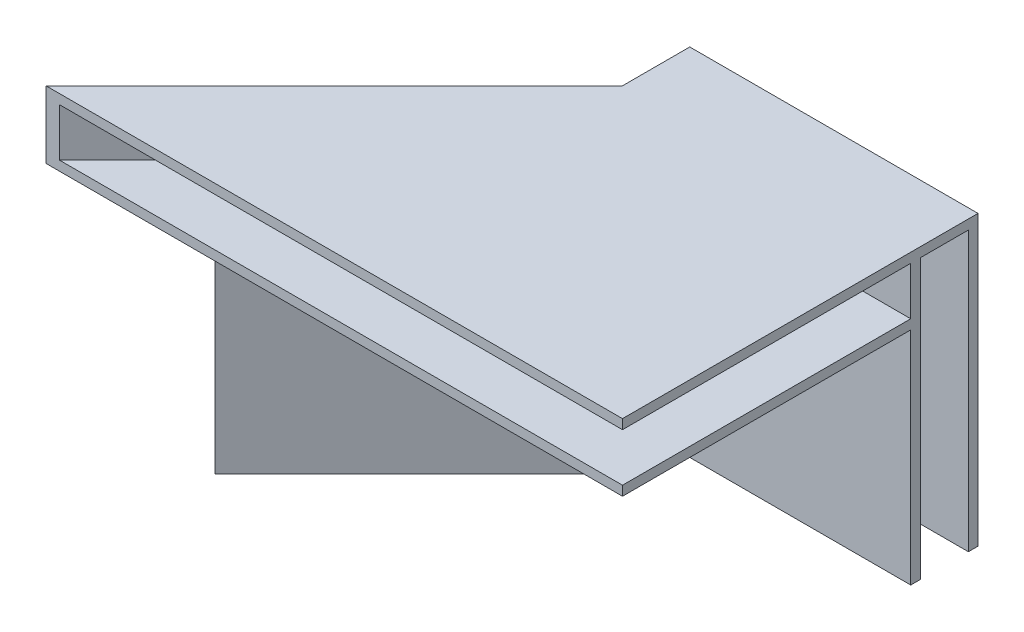
ISO-10303-21;
HEADER;
FILE_DESCRIPTION(('STEP AP214'),'2;1');
FILE_NAME('part.step','',(''),(''),'','','');
FILE_SCHEMA(('AUTOMOTIVE_DESIGN { 1 0 10303 214 1 1 1 1 }'));
ENDSEC;
DATA;
#1=APPLICATION_CONTEXT('core data for automotive mechanical design processes');
#2=APPLICATION_PROTOCOL_DEFINITION('international standard','automotive_design',2000,#1);
#3=PRODUCT_CONTEXT('',#1,'mechanical');
#4=PRODUCT('Part','Part','',(#3));
#5=PRODUCT_RELATED_PRODUCT_CATEGORY('part','',(#4));
#6=PRODUCT_DEFINITION_FORMATION('','',#4);
#7=PRODUCT_DEFINITION_CONTEXT('part definition',#1,'design');
#8=PRODUCT_DEFINITION('design','',#6,#7);
#9=PRODUCT_DEFINITION_SHAPE('','',#8);
#10=(LENGTH_UNIT() NAMED_UNIT(*) SI_UNIT(.MILLI.,.METRE.));
#11=(NAMED_UNIT(*) PLANE_ANGLE_UNIT() SI_UNIT($,.RADIAN.));
#12=(NAMED_UNIT(*) SI_UNIT($,.STERADIAN.) SOLID_ANGLE_UNIT());
#13=UNCERTAINTY_MEASURE_WITH_UNIT(LENGTH_MEASURE(1.E-05),#10,'distance_accuracy_value','');
#14=(GEOMETRIC_REPRESENTATION_CONTEXT(3) GLOBAL_UNCERTAINTY_ASSIGNED_CONTEXT((#13)) GLOBAL_UNIT_ASSIGNED_CONTEXT((#10,
#11,#12)) REPRESENTATION_CONTEXT('',''));
#15=CARTESIAN_POINT('',(0.,0.,0.));
#16=DIRECTION('',(0.,0.,1.));
#17=DIRECTION('',(1.,0.,0.));
#18=AXIS2_PLACEMENT_3D('',#15,#16,#17);
#19=CARTESIAN_POINT('',(0.,0.,7.));
#20=DIRECTION('',(0.,0.,-1.));
#21=DIRECTION('',(-1.,0.,0.));
#22=AXIS2_PLACEMENT_3D('',#19,#20,#21);
#23=PLANE('',#22);
#24=DIRECTION('',(0.,-1.,0.));
#25=VECTOR('',#24,1.);
#26=CARTESIAN_POINT('',(1.,0.,7.));
#27=LINE('',#26,#25);
#28=CARTESIAN_POINT('',(1.,29.,7.));
#29=VERTEX_POINT('',#28);
#30=CARTESIAN_POINT('',(1.,24.,7.));
#31=VERTEX_POINT('',#30);
#32=EDGE_CURVE('E197',#29,#31,#27,.T.);
#33=ORIENTED_EDGE('',*,*,#32,.T.);
#34=DIRECTION('',(1.,0.,0.));
#35=VECTOR('',#34,1.);
#36=CARTESIAN_POINT('',(0.,24.,7.));
#37=LINE('',#36,#35);
#38=CARTESIAN_POINT('',(30.,24.,7.));
#39=VERTEX_POINT('',#38);
#40=EDGE_CURVE('E191',#31,#39,#37,.T.);
#41=ORIENTED_EDGE('',*,*,#40,.T.);
#42=DIRECTION('',(0.,1.,0.));
#43=VECTOR('',#42,1.);
#44=CARTESIAN_POINT('',(30.,24.,7.));
#45=LINE('',#44,#43);
#46=CARTESIAN_POINT('',(30.,29.,7.));
#47=VERTEX_POINT('',#46);
#48=EDGE_CURVE('E194',#39,#47,#45,.T.);
#49=ORIENTED_EDGE('',*,*,#48,.T.);
#50=DIRECTION('',(1.,0.,0.));
#51=VECTOR('',#50,1.);
#52=CARTESIAN_POINT('',(0.,29.,7.));
#53=LINE('',#52,#51);
#54=EDGE_CURVE('E201',#29,#47,#53,.T.);
#55=ORIENTED_EDGE('',*,*,#54,.F.);
#56=EDGE_LOOP('',(#33,#41,#49,#55));
#57=FACE_BOUND('',#56,.T.);
#58=ADVANCED_FACE('F35',(#57),#23,.F.);
#59=CARTESIAN_POINT('',(0.,23.,37.));
#60=DIRECTION('',(0.,1.,0.));
#61=DIRECTION('',(0.,0.,1.));
#62=AXIS2_PLACEMENT_3D('',#59,#60,#61);
#63=PLANE('',#62);
#64=DIRECTION('',(1.,0.,0.));
#65=VECTOR('',#64,1.);
#66=CARTESIAN_POINT('',(0.,23.,37.));
#67=LINE('',#66,#65);
#68=CARTESIAN_POINT('',(-30.,23.,37.));
#69=VERTEX_POINT('',#68);
#70=CARTESIAN_POINT('',(30.,23.,37.));
#71=VERTEX_POINT('',#70);
#72=EDGE_CURVE('E304',#69,#71,#67,.T.);
#73=ORIENTED_EDGE('',*,*,#72,.F.);
#74=DIRECTION('',(-0.707106781186547,0.,0.707106781186547));
#75=VECTOR('',#74,1.);
#76=CARTESIAN_POINT('',(-30.,23.,37.));
#77=LINE('',#76,#75);
#78=CARTESIAN_POINT('',(-21.2132034355964,23.,28.2132034355964));
#79=VERTEX_POINT('',#78);
#80=EDGE_CURVE('E240',#79,#69,#77,.T.);
#81=ORIENTED_EDGE('',*,*,#80,.F.);
#82=DIRECTION('',(-0.707106781186547,0.,-0.707106781186548));
#83=VECTOR('',#82,1.);
#84=CARTESIAN_POINT('',(-16.2132034355964,23.,33.2132034355964));
#85=LINE('',#84,#83);
#86=CARTESIAN_POINT('',(-16.2132034355964,23.,33.2132034355964));
#87=VERTEX_POINT('',#86);
#88=EDGE_CURVE('E58',#87,#79,#85,.T.);
#89=ORIENTED_EDGE('',*,*,#88,.F.);
#90=DIRECTION('',(0.707106781186548,0.,-0.707106781186547));
#91=VECTOR('',#90,1.);
#92=CARTESIAN_POINT('',(-16.2132034355964,23.,33.2132034355964));
#93=LINE('',#92,#91);
#94=CARTESIAN_POINT('',(5.,23.,12.));
#95=VERTEX_POINT('',#94);
#96=EDGE_CURVE('E280',#87,#95,#93,.T.);
#97=ORIENTED_EDGE('',*,*,#96,.T.);
#98=DIRECTION('',(0.,0.,-1.));
#99=VECTOR('',#98,1.);
#100=CARTESIAN_POINT('',(5.,23.,12.));
#101=LINE('',#100,#99);
#102=CARTESIAN_POINT('',(5.,23.,7.));
#103=VERTEX_POINT('',#102);
#104=EDGE_CURVE('E292',#95,#103,#101,.T.);
#105=ORIENTED_EDGE('',*,*,#104,.T.);
#106=DIRECTION('',(1.,0.,0.));
#107=VECTOR('',#106,1.);
#108=CARTESIAN_POINT('',(0.,23.,7.));
#109=LINE('',#108,#107);
#110=CARTESIAN_POINT('',(30.,23.,7.));
#111=VERTEX_POINT('',#110);
#112=EDGE_CURVE('E302',#103,#111,#109,.T.);
#113=ORIENTED_EDGE('',*,*,#112,.T.);
#114=DIRECTION('',(0.,0.,-1.));
#115=VECTOR('',#114,1.);
#116=CARTESIAN_POINT('',(30.,23.,37.));
#117=LINE('',#116,#115);
#118=EDGE_CURVE('E312',#71,#111,#117,.T.);
#119=ORIENTED_EDGE('',*,*,#118,.F.);
#120=EDGE_LOOP('',(#73,#81,#89,#97,#105,#113,#119));
#121=FACE_BOUND('',#120,.T.);
#122=ADVANCED_FACE('F400',(#121),#63,.F.);
#123=CARTESIAN_POINT('',(0.,0.,7.));
#124=DIRECTION('',(0.,0.,-1.));
#125=DIRECTION('',(-1.,0.,0.));
#126=AXIS2_PLACEMENT_3D('',#123,#124,#125);
#127=PLANE('',#126);
#128=DIRECTION('',(0.,1.,0.));
#129=VECTOR('',#128,1.);
#130=CARTESIAN_POINT('',(5.,0.,7.));
#131=LINE('',#130,#129);
#132=CARTESIAN_POINT('',(5.,0.,7.));
#133=VERTEX_POINT('',#132);
#134=EDGE_CURVE('E288',#133,#103,#131,.T.);
#135=ORIENTED_EDGE('',*,*,#134,.F.);
#136=DIRECTION('',(1.,0.,0.));
#137=VECTOR('',#136,1.);
#138=CARTESIAN_POINT('',(0.,0.,7.));
#139=LINE('',#138,#137);
#140=CARTESIAN_POINT('',(30.,0.,7.));
#141=VERTEX_POINT('',#140);
#142=EDGE_CURVE('E345',#133,#141,#139,.T.);
#143=ORIENTED_EDGE('',*,*,#142,.T.);
#144=DIRECTION('',(0.,1.,0.));
#145=VECTOR('',#144,1.);
#146=CARTESIAN_POINT('',(30.,0.,7.));
#147=LINE('',#146,#145);
#148=EDGE_CURVE('E347',#141,#111,#147,.T.);
#149=ORIENTED_EDGE('',*,*,#148,.T.);
#150=ORIENTED_EDGE('',*,*,#112,.F.);
#151=EDGE_LOOP('',(#135,#143,#149,#150));
#152=FACE_BOUND('',#151,.T.);
#153=ADVANCED_FACE('F403',(#152),#127,.F.);
#154=CARTESIAN_POINT('',(0.,0.,7.));
#155=DIRECTION('',(1.,0.,0.));
#156=DIRECTION('',(0.,0.,-1.));
#157=AXIS2_PLACEMENT_3D('',#154,#155,#156);
#158=PLANE('',#157);
#159=DIRECTION('',(0.,0.,-1.));
#160=VECTOR('',#159,1.);
#161=CARTESIAN_POINT('',(0.,0.,7.));
#162=LINE('',#161,#160);
#163=CARTESIAN_POINT('',(0.,0.,7.));
#164=VERTEX_POINT('',#163);
#165=CARTESIAN_POINT('',(0.,0.,0.));
#166=VERTEX_POINT('',#165);
#167=EDGE_CURVE('E11',#164,#166,#162,.T.);
#168=ORIENTED_EDGE('',*,*,#167,.F.);
#169=DIRECTION('',(0.,-1.,0.));
#170=VECTOR('',#169,1.);
#171=CARTESIAN_POINT('',(0.,23.,7.));
#172=LINE('',#171,#170);
#173=CARTESIAN_POINT('',(0.,30.,7.));
#174=VERTEX_POINT('',#173);
#175=EDGE_CURVE('E299',#174,#164,#172,.T.);
#176=ORIENTED_EDGE('',*,*,#175,.F.);
#177=DIRECTION('',(0.,0.,-1.));
#178=VECTOR('',#177,1.);
#179=CARTESIAN_POINT('',(0.,30.,7.));
#180=LINE('',#179,#178);
#181=CARTESIAN_POINT('',(0.,30.,0.));
#182=VERTEX_POINT('',#181);
#183=EDGE_CURVE('E351',#174,#182,#180,.T.);
#184=ORIENTED_EDGE('',*,*,#183,.T.);
#185=DIRECTION('',(0.,-1.,0.));
#186=VECTOR('',#185,1.);
#187=CARTESIAN_POINT('',(0.,0.,0.));
#188=LINE('',#187,#186);
#189=EDGE_CURVE('E336',#182,#166,#188,.T.);
#190=ORIENTED_EDGE('',*,*,#189,.T.);
#191=EDGE_LOOP('',(#168,#176,#184,#190));
#192=FACE_BOUND('',#191,.T.);
#193=ADVANCED_FACE('F37',(#192),#158,.F.);
#194=CARTESIAN_POINT('',(0.,0.,7.));
#195=DIRECTION('',(0.,1.,0.));
#196=DIRECTION('',(0.,0.,1.));
#197=AXIS2_PLACEMENT_3D('',#194,#195,#196);
#198=PLANE('',#197);
#199=DIRECTION('',(0.707106781186547,0.,0.707106781186548));
#200=VECTOR('',#199,1.);
#201=CARTESIAN_POINT('',(-21.2132034355964,0.,28.2132034355964));
#202=LINE('',#201,#200);
#203=CARTESIAN_POINT('',(-16.920310216783,0.,32.5060966544099));
#204=VERTEX_POINT('',#203);
#205=CARTESIAN_POINT('',(-16.2132034355964,0.,33.2132034355964));
#206=VERTEX_POINT('',#205);
#207=EDGE_CURVE('E273',#204,#206,#202,.T.);
#208=ORIENTED_EDGE('',*,*,#207,.F.);
#209=DIRECTION('',(-0.707106781186546,0.,0.707106781186549));
#210=VECTOR('',#209,1.);
#211=CARTESIAN_POINT('',(-16.2132034355964,0.,31.7989898732233));
#212=LINE('',#211,#210);
#213=CARTESIAN_POINT('',(4.29289321881345,0.,11.2928932188134));
#214=VERTEX_POINT('',#213);
#215=EDGE_CURVE('E250',#214,#204,#212,.T.);
#216=ORIENTED_EDGE('',*,*,#215,.F.);
#217=DIRECTION('',(0.707106781186547,0.,0.707106781186547));
#218=VECTOR('',#217,1.);
#219=CARTESIAN_POINT('',(4.29289321881345,0.,11.2928932188134));
#220=LINE('',#219,#218);
#221=CARTESIAN_POINT('',(0.707106781186545,0.,7.70710678118655));
#222=VERTEX_POINT('',#221);
#223=EDGE_CURVE('E260',#222,#214,#220,.T.);
#224=ORIENTED_EDGE('',*,*,#223,.F.);
#225=DIRECTION('',(0.707106781186548,0.,-0.707106781186548));
#226=VECTOR('',#225,1.);
#227=CARTESIAN_POINT('',(-19.7989898732233,0.,28.2132034355964));
#228=LINE('',#227,#226);
#229=CARTESIAN_POINT('',(-20.5060966544099,0.,28.920310216783));
#230=VERTEX_POINT('',#229);
#231=EDGE_CURVE('E245',#230,#222,#228,.T.);
#232=ORIENTED_EDGE('',*,*,#231,.F.);
#233=CARTESIAN_POINT('',(-21.2132034355964,0.,28.2132034355964));
#234=VERTEX_POINT('',#233);
#235=EDGE_CURVE('E274',#234,#230,#202,.T.);
#236=ORIENTED_EDGE('',*,*,#235,.F.);
#237=DIRECTION('',(0.707106781186548,0.,-0.707106781186547));
#238=VECTOR('',#237,1.);
#239=CARTESIAN_POINT('',(-21.2132034355964,0.,28.2132034355964));
#240=LINE('',#239,#238);
#241=EDGE_CURVE('E285',#234,#164,#240,.T.);
#242=ORIENTED_EDGE('',*,*,#241,.T.);
#243=ORIENTED_EDGE('',*,*,#167,.T.);
#244=DIRECTION('',(1.,0.,0.));
#245=VECTOR('',#244,1.);
#246=CARTESIAN_POINT('',(0.,0.,0.));
#247=LINE('',#246,#245);
#248=CARTESIAN_POINT('',(30.,0.,0.));
#249=VERTEX_POINT('',#248);
#250=EDGE_CURVE('E354',#166,#249,#247,.T.);
#251=ORIENTED_EDGE('',*,*,#250,.T.);
#252=DIRECTION('',(0.,0.,-1.));
#253=VECTOR('',#252,1.);
#254=CARTESIAN_POINT('',(30.,0.,7.));
#255=LINE('',#254,#253);
#256=CARTESIAN_POINT('',(30.,0.,1.));
#257=VERTEX_POINT('',#256);
#258=EDGE_CURVE('E364',#257,#249,#255,.T.);
#259=ORIENTED_EDGE('',*,*,#258,.F.);
#260=DIRECTION('',(1.,0.,0.));
#261=VECTOR('',#260,1.);
#262=CARTESIAN_POINT('',(0.,0.,1.));
#263=LINE('',#262,#261);
#264=CARTESIAN_POINT('',(1.,0.,1.));
#265=VERTEX_POINT('',#264);
#266=EDGE_CURVE('E319',#265,#257,#263,.T.);
#267=ORIENTED_EDGE('',*,*,#266,.F.);
#268=DIRECTION('',(0.,0.,-1.));
#269=VECTOR('',#268,1.);
#270=CARTESIAN_POINT('',(1.,0.,7.));
#271=LINE('',#270,#269);
#272=CARTESIAN_POINT('',(1.,0.,6.));
#273=VERTEX_POINT('',#272);
#274=EDGE_CURVE('E334',#273,#265,#271,.T.);
#275=ORIENTED_EDGE('',*,*,#274,.F.);
#276=DIRECTION('',(1.,0.,0.));
#277=VECTOR('',#276,1.);
#278=CARTESIAN_POINT('',(0.,0.,6.));
#279=LINE('',#278,#277);
#280=CARTESIAN_POINT('',(30.,0.,6.));
#281=VERTEX_POINT('',#280);
#282=EDGE_CURVE('E323',#273,#281,#279,.T.);
#283=ORIENTED_EDGE('',*,*,#282,.T.);
#284=EDGE_CURVE('E43',#141,#281,#255,.T.);
#285=ORIENTED_EDGE('',*,*,#284,.F.);
#286=ORIENTED_EDGE('',*,*,#142,.F.);
#287=DIRECTION('',(0.,0.,-1.));
#288=VECTOR('',#287,1.);
#289=CARTESIAN_POINT('',(5.,0.,12.));
#290=LINE('',#289,#288);
#291=CARTESIAN_POINT('',(5.,0.,12.));
#292=VERTEX_POINT('',#291);
#293=EDGE_CURVE('E296',#292,#133,#290,.T.);
#294=ORIENTED_EDGE('',*,*,#293,.F.);
#295=DIRECTION('',(0.707106781186548,0.,-0.707106781186547));
#296=VECTOR('',#295,1.);
#297=CARTESIAN_POINT('',(-16.2132034355964,0.,33.2132034355964));
#298=LINE('',#297,#296);
#299=EDGE_CURVE('E282',#206,#292,#298,.T.);
#300=ORIENTED_EDGE('',*,*,#299,.F.);
#301=EDGE_LOOP('',(#208,#216,#224,#232,#236,#242,#243,#251,#259,#267,#275,#283,#285,#286,#294,#300));
#302=FACE_BOUND('',#301,.T.);
#303=ADVANCED_FACE('F376',(#302),#198,.F.);
#304=CARTESIAN_POINT('',(30.,0.,7.));
#305=DIRECTION('',(-1.,0.,0.));
#306=DIRECTION('',(0.,0.,1.));
#307=AXIS2_PLACEMENT_3D('',#304,#305,#306);
#308=PLANE('',#307);
#309=DIRECTION('',(0.,1.,0.));
#310=VECTOR('',#309,1.);
#311=CARTESIAN_POINT('',(30.,30.,37.));
#312=LINE('',#311,#310);
#313=CARTESIAN_POINT('',(30.,29.,37.));
#314=VERTEX_POINT('',#313);
#315=CARTESIAN_POINT('',(30.,30.,37.));
#316=VERTEX_POINT('',#315);
#317=EDGE_CURVE('E306',#314,#316,#312,.T.);
#318=ORIENTED_EDGE('',*,*,#317,.F.);
#319=DIRECTION('',(0.,0.,1.));
#320=VECTOR('',#319,1.);
#321=CARTESIAN_POINT('',(30.,29.,36.));
#322=LINE('',#321,#320);
#323=EDGE_CURVE('E215',#47,#314,#322,.T.);
#324=ORIENTED_EDGE('',*,*,#323,.F.);
#325=ORIENTED_EDGE('',*,*,#48,.F.);
#326=DIRECTION('',(0.,0.,-1.));
#327=VECTOR('',#326,1.);
#328=CARTESIAN_POINT('',(30.,24.,36.));
#329=LINE('',#328,#327);
#330=CARTESIAN_POINT('',(30.,24.,37.));
#331=VERTEX_POINT('',#330);
#332=EDGE_CURVE('E204',#331,#39,#329,.T.);
#333=ORIENTED_EDGE('',*,*,#332,.F.);
#334=EDGE_CURVE('E307',#71,#331,#312,.T.);
#335=ORIENTED_EDGE('',*,*,#334,.F.);
#336=ORIENTED_EDGE('',*,*,#118,.T.);
#337=ORIENTED_EDGE('',*,*,#148,.F.);
#338=ORIENTED_EDGE('',*,*,#284,.T.);
#339=DIRECTION('',(0.,1.,0.));
#340=VECTOR('',#339,1.);
#341=CARTESIAN_POINT('',(30.,0.,6.));
#342=LINE('',#341,#340);
#343=CARTESIAN_POINT('',(30.,29.,6.));
#344=VERTEX_POINT('',#343);
#345=EDGE_CURVE('E333',#281,#344,#342,.T.);
#346=ORIENTED_EDGE('',*,*,#345,.T.);
#347=DIRECTION('',(0.,0.,-1.));
#348=VECTOR('',#347,1.);
#349=CARTESIAN_POINT('',(30.,29.,7.));
#350=LINE('',#349,#348);
#351=CARTESIAN_POINT('',(30.,29.,1.));
#352=VERTEX_POINT('',#351);
#353=EDGE_CURVE('E328',#344,#352,#350,.T.);
#354=ORIENTED_EDGE('',*,*,#353,.T.);
#355=DIRECTION('',(0.,1.,0.));
#356=VECTOR('',#355,1.);
#357=CARTESIAN_POINT('',(30.,0.,1.));
#358=LINE('',#357,#356);
#359=EDGE_CURVE('E331',#257,#352,#358,.T.);
#360=ORIENTED_EDGE('',*,*,#359,.F.);
#361=ORIENTED_EDGE('',*,*,#258,.T.);
#362=DIRECTION('',(0.,1.,0.));
#363=VECTOR('',#362,1.);
#364=CARTESIAN_POINT('',(30.,0.,0.));
#365=LINE('',#364,#363);
#366=CARTESIAN_POINT('',(30.,30.,0.));
#367=VERTEX_POINT('',#366);
#368=EDGE_CURVE('E357',#249,#367,#365,.T.);
#369=ORIENTED_EDGE('',*,*,#368,.T.);
#370=DIRECTION('',(0.,0.,-1.));
#371=VECTOR('',#370,1.);
#372=CARTESIAN_POINT('',(30.,30.,7.));
#373=LINE('',#372,#371);
#374=EDGE_CURVE('E362',#316,#367,#373,.T.);
#375=ORIENTED_EDGE('',*,*,#374,.F.);
#376=EDGE_LOOP('',(#318,#324,#325,#333,#335,#336,#337,#338,#346,#354,#360,#361,#369,#375));
#377=FACE_BOUND('',#376,.T.);
#378=ADVANCED_FACE('F213',(#377),#308,.F.);
#379=CARTESIAN_POINT('',(0.,30.,7.));
#380=DIRECTION('',(0.,-1.,0.));
#381=DIRECTION('',(0.,0.,-1.));
#382=AXIS2_PLACEMENT_3D('',#379,#380,#381);
#383=PLANE('',#382);
#384=ORIENTED_EDGE('',*,*,#183,.F.);
#385=DIRECTION('',(-0.707106781186548,0.,0.707106781186548));
#386=VECTOR('',#385,1.);
#387=CARTESIAN_POINT('',(0.,30.,7.));
#388=LINE('',#387,#386);
#389=CARTESIAN_POINT('',(-30.,30.,37.));
#390=VERTEX_POINT('',#389);
#391=EDGE_CURVE('E242',#174,#390,#388,.T.);
#392=ORIENTED_EDGE('',*,*,#391,.T.);
#393=DIRECTION('',(-1.,0.,0.));
#394=VECTOR('',#393,1.);
#395=CARTESIAN_POINT('',(0.,30.,37.));
#396=LINE('',#395,#394);
#397=EDGE_CURVE('E309',#316,#390,#396,.T.);
#398=ORIENTED_EDGE('',*,*,#397,.F.);
#399=ORIENTED_EDGE('',*,*,#374,.T.);
#400=DIRECTION('',(-1.,0.,0.));
#401=VECTOR('',#400,1.);
#402=CARTESIAN_POINT('',(0.,30.,0.));
#403=LINE('',#402,#401);
#404=EDGE_CURVE('E348',#367,#182,#403,.T.);
#405=ORIENTED_EDGE('',*,*,#404,.T.);
#406=EDGE_LOOP('',(#384,#392,#398,#399,#405));
#407=FACE_BOUND('',#406,.T.);
#408=ADVANCED_FACE('F384',(#407),#383,.F.);
#409=CARTESIAN_POINT('',(0.,0.,0.));
#410=DIRECTION('',(0.,0.,-1.));
#411=DIRECTION('',(-1.,0.,0.));
#412=AXIS2_PLACEMENT_3D('',#409,#410,#411);
#413=PLANE('',#412);
#414=ORIENTED_EDGE('',*,*,#189,.F.);
#415=ORIENTED_EDGE('',*,*,#404,.F.);
#416=ORIENTED_EDGE('',*,*,#368,.F.);
#417=ORIENTED_EDGE('',*,*,#250,.F.);
#418=EDGE_LOOP('',(#414,#415,#416,#417));
#419=FACE_BOUND('',#418,.T.);
#420=ADVANCED_FACE('F381',(#419),#413,.T.);
#421=CARTESIAN_POINT('',(1.,0.,7.));
#422=DIRECTION('',(1.,0.,0.));
#423=DIRECTION('',(0.,0.,-1.));
#424=AXIS2_PLACEMENT_3D('',#421,#422,#423);
#425=PLANE('',#424);
#426=DIRECTION('',(0.,-1.,0.));
#427=VECTOR('',#426,1.);
#428=CARTESIAN_POINT('',(1.,0.,1.));
#429=LINE('',#428,#427);
#430=CARTESIAN_POINT('',(1.,29.,1.));
#431=VERTEX_POINT('',#430);
#432=EDGE_CURVE('E316',#431,#265,#429,.T.);
#433=ORIENTED_EDGE('',*,*,#432,.F.);
#434=DIRECTION('',(0.,0.,-1.));
#435=VECTOR('',#434,1.);
#436=CARTESIAN_POINT('',(1.,29.,7.));
#437=LINE('',#436,#435);
#438=CARTESIAN_POINT('',(1.,29.,6.));
#439=VERTEX_POINT('',#438);
#440=EDGE_CURVE('E325',#439,#431,#437,.T.);
#441=ORIENTED_EDGE('',*,*,#440,.F.);
#442=DIRECTION('',(0.,-1.,0.));
#443=VECTOR('',#442,1.);
#444=CARTESIAN_POINT('',(1.,0.,6.));
#445=LINE('',#444,#443);
#446=EDGE_CURVE('E320',#439,#273,#445,.T.);
#447=ORIENTED_EDGE('',*,*,#446,.T.);
#448=ORIENTED_EDGE('',*,*,#274,.T.);
#449=EDGE_LOOP('',(#433,#441,#447,#448));
#450=FACE_BOUND('',#449,.T.);
#451=ADVANCED_FACE('F412',(#450),#425,.T.);
#452=CARTESIAN_POINT('',(0.,29.,7.));
#453=DIRECTION('',(0.,-1.,0.));
#454=DIRECTION('',(0.,0.,-1.));
#455=AXIS2_PLACEMENT_3D('',#452,#453,#454);
#456=PLANE('',#455);
#457=DIRECTION('',(-1.,0.,0.));
#458=VECTOR('',#457,1.);
#459=CARTESIAN_POINT('',(0.,29.,1.));
#460=LINE('',#459,#458);
#461=EDGE_CURVE('E324',#352,#431,#460,.T.);
#462=ORIENTED_EDGE('',*,*,#461,.F.);
#463=ORIENTED_EDGE('',*,*,#353,.F.);
#464=DIRECTION('',(-1.,0.,0.));
#465=VECTOR('',#464,1.);
#466=CARTESIAN_POINT('',(0.,29.,6.));
#467=LINE('',#466,#465);
#468=EDGE_CURVE('E329',#344,#439,#467,.T.);
#469=ORIENTED_EDGE('',*,*,#468,.T.);
#470=ORIENTED_EDGE('',*,*,#440,.T.);
#471=EDGE_LOOP('',(#462,#463,#469,#470));
#472=FACE_BOUND('',#471,.T.);
#473=ADVANCED_FACE('F415',(#472),#456,.T.);
#474=CARTESIAN_POINT('',(0.,0.,6.));
#475=DIRECTION('',(0.,0.,-1.));
#476=DIRECTION('',(-1.,0.,0.));
#477=AXIS2_PLACEMENT_3D('',#474,#475,#476);
#478=PLANE('',#477);
#479=ORIENTED_EDGE('',*,*,#446,.F.);
#480=ORIENTED_EDGE('',*,*,#468,.F.);
#481=ORIENTED_EDGE('',*,*,#345,.F.);
#482=ORIENTED_EDGE('',*,*,#282,.F.);
#483=EDGE_LOOP('',(#479,#480,#481,#482));
#484=FACE_BOUND('',#483,.T.);
#485=ADVANCED_FACE('F408',(#484),#478,.T.);
#486=CARTESIAN_POINT('',(0.,0.,1.));
#487=DIRECTION('',(0.,0.,-1.));
#488=DIRECTION('',(-1.,0.,0.));
#489=AXIS2_PLACEMENT_3D('',#486,#487,#488);
#490=PLANE('',#489);
#491=ORIENTED_EDGE('',*,*,#432,.T.);
#492=ORIENTED_EDGE('',*,*,#266,.T.);
#493=ORIENTED_EDGE('',*,*,#359,.T.);
#494=ORIENTED_EDGE('',*,*,#461,.T.);
#495=EDGE_LOOP('',(#491,#492,#493,#494));
#496=FACE_BOUND('',#495,.T.);
#497=ADVANCED_FACE('F418',(#496),#490,.F.);
#498=CARTESIAN_POINT('',(0.,0.,37.));
#499=DIRECTION('',(0.,0.,1.));
#500=DIRECTION('',(1.,0.,0.));
#501=AXIS2_PLACEMENT_3D('',#498,#499,#500);
#502=PLANE('',#501);
#503=DIRECTION('',(-1.,0.,0.));
#504=VECTOR('',#503,1.);
#505=CARTESIAN_POINT('',(0.,29.,37.));
#506=LINE('',#505,#504);
#507=CARTESIAN_POINT('',(-28.5857864376269,29.,37.));
#508=VERTEX_POINT('',#507);
#509=EDGE_CURVE('E231',#314,#508,#506,.T.);
#510=ORIENTED_EDGE('',*,*,#509,.F.);
#511=ORIENTED_EDGE('',*,*,#317,.T.);
#512=ORIENTED_EDGE('',*,*,#397,.T.);
#513=DIRECTION('',(0.,1.,0.));
#514=VECTOR('',#513,1.);
#515=CARTESIAN_POINT('',(-30.,23.,37.));
#516=LINE('',#515,#514);
#517=EDGE_CURVE('E300',#69,#390,#516,.T.);
#518=ORIENTED_EDGE('',*,*,#517,.F.);
#519=ORIENTED_EDGE('',*,*,#72,.T.);
#520=ORIENTED_EDGE('',*,*,#334,.T.);
#521=DIRECTION('',(1.,0.,0.));
#522=VECTOR('',#521,1.);
#523=CARTESIAN_POINT('',(0.,24.,37.));
#524=LINE('',#523,#522);
#525=CARTESIAN_POINT('',(-28.5857864376269,24.,37.));
#526=VERTEX_POINT('',#525);
#527=EDGE_CURVE('E207',#526,#331,#524,.T.);
#528=ORIENTED_EDGE('',*,*,#527,.F.);
#529=DIRECTION('',(0.,1.,0.));
#530=VECTOR('',#529,1.);
#531=CARTESIAN_POINT('',(-28.5857864376269,0.,37.));
#532=LINE('',#531,#530);
#533=EDGE_CURVE('E227',#526,#508,#532,.T.);
#534=ORIENTED_EDGE('',*,*,#533,.T.);
#535=EDGE_LOOP('',(#510,#511,#512,#518,#519,#520,#528,#534));
#536=FACE_BOUND('',#535,.T.);
#537=ADVANCED_FACE('F387',(#536),#502,.T.);
#538=CARTESIAN_POINT('',(5.,0.,12.));
#539=DIRECTION('',(-1.,0.,0.));
#540=DIRECTION('',(0.,0.,1.));
#541=AXIS2_PLACEMENT_3D('',#538,#539,#540);
#542=PLANE('',#541);
#543=ORIENTED_EDGE('',*,*,#134,.T.);
#544=ORIENTED_EDGE('',*,*,#104,.F.);
#545=DIRECTION('',(0.,1.,0.));
#546=VECTOR('',#545,1.);
#547=CARTESIAN_POINT('',(5.,0.,12.));
#548=LINE('',#547,#546);
#549=EDGE_CURVE('E289',#292,#95,#548,.T.);
#550=ORIENTED_EDGE('',*,*,#549,.F.);
#551=ORIENTED_EDGE('',*,*,#293,.T.);
#552=EDGE_LOOP('',(#543,#544,#550,#551));
#553=FACE_BOUND('',#552,.T.);
#554=ADVANCED_FACE('F425',(#553),#542,.F.);
#555=CARTESIAN_POINT('',(-21.2132034355964,23.,28.2132034355964));
#556=DIRECTION('',(0.707106781186547,0.,0.707106781186548));
#557=DIRECTION('',(0.707106781186548,0.,-0.707106781186547));
#558=AXIS2_PLACEMENT_3D('',#555,#556,#557);
#559=PLANE('',#558);
#560=ORIENTED_EDGE('',*,*,#175,.T.);
#561=ORIENTED_EDGE('',*,*,#241,.F.);
#562=DIRECTION('',(0.,-1.,0.));
#563=VECTOR('',#562,1.);
#564=CARTESIAN_POINT('',(-21.2132034355964,23.,28.2132034355964));
#565=LINE('',#564,#563);
#566=EDGE_CURVE('E265',#79,#234,#565,.T.);
#567=ORIENTED_EDGE('',*,*,#566,.F.);
#568=ORIENTED_EDGE('',*,*,#80,.T.);
#569=ORIENTED_EDGE('',*,*,#517,.T.);
#570=ORIENTED_EDGE('',*,*,#391,.F.);
#571=EDGE_LOOP('',(#560,#561,#567,#568,#569,#570));
#572=FACE_BOUND('',#571,.T.);
#573=ADVANCED_FACE('F462',(#572),#559,.F.);
#574=CARTESIAN_POINT('',(-16.2132034355964,0.,33.2132034355964));
#575=DIRECTION('',(-0.707106781186547,0.,-0.707106781186548));
#576=DIRECTION('',(-0.707106781186548,0.,0.707106781186547));
#577=AXIS2_PLACEMENT_3D('',#574,#575,#576);
#578=PLANE('',#577);
#579=ORIENTED_EDGE('',*,*,#549,.T.);
#580=ORIENTED_EDGE('',*,*,#96,.F.);
#581=DIRECTION('',(0.,1.,0.));
#582=VECTOR('',#581,1.);
#583=CARTESIAN_POINT('',(-16.2132034355964,0.,33.2132034355964));
#584=LINE('',#583,#582);
#585=EDGE_CURVE('E277',#206,#87,#584,.T.);
#586=ORIENTED_EDGE('',*,*,#585,.F.);
#587=ORIENTED_EDGE('',*,*,#299,.T.);
#588=EDGE_LOOP('',(#579,#580,#586,#587));
#589=FACE_BOUND('',#588,.T.);
#590=ADVANCED_FACE('F458',(#589),#578,.F.);
#591=CARTESIAN_POINT('',(-24.7132034355964,0.,24.7132034355964));
#592=DIRECTION('',(-0.707106781186548,0.,0.707106781186547));
#593=DIRECTION('',(0.707106781186547,0.,0.707106781186548));
#594=AXIS2_PLACEMENT_3D('',#591,#592,#593);
#595=PLANE('',#594);
#596=DIRECTION('',(0.,-1.,0.));
#597=VECTOR('',#596,1.);
#598=CARTESIAN_POINT('',(-16.920310216783,22.,32.5060966544099));
#599=LINE('',#598,#597);
#600=CARTESIAN_POINT('',(-16.920310216783,22.,32.5060966544099));
#601=VERTEX_POINT('',#600);
#602=EDGE_CURVE('E50',#601,#204,#599,.T.);
#603=ORIENTED_EDGE('',*,*,#602,.T.);
#604=ORIENTED_EDGE('',*,*,#207,.T.);
#605=ORIENTED_EDGE('',*,*,#585,.T.);
#606=ORIENTED_EDGE('',*,*,#88,.T.);
#607=ORIENTED_EDGE('',*,*,#566,.T.);
#608=ORIENTED_EDGE('',*,*,#235,.T.);
#609=DIRECTION('',(0.,-1.,0.));
#610=VECTOR('',#609,1.);
#611=CARTESIAN_POINT('',(-20.5060966544099,22.,28.920310216783));
#612=LINE('',#611,#610);
#613=CARTESIAN_POINT('',(-20.5060966544099,22.,28.920310216783));
#614=VERTEX_POINT('',#613);
#615=EDGE_CURVE('E257',#614,#230,#612,.T.);
#616=ORIENTED_EDGE('',*,*,#615,.F.);
#617=DIRECTION('',(-0.707106781186548,0.,-0.707106781186547));
#618=VECTOR('',#617,1.);
#619=CARTESIAN_POINT('',(-16.920310216783,22.,32.5060966544099));
#620=LINE('',#619,#618);
#621=EDGE_CURVE('E246',#601,#614,#620,.T.);
#622=ORIENTED_EDGE('',*,*,#621,.F.);
#623=EDGE_LOOP('',(#603,#604,#605,#606,#607,#608,#616,#622));
#624=FACE_BOUND('',#623,.T.);
#625=ADVANCED_FACE('F449',(#624),#595,.T.);
#626=CARTESIAN_POINT('',(-16.2132034355964,22.,31.7989898732233));
#627=DIRECTION('',(0.707106781186549,0.,0.707106781186546));
#628=DIRECTION('',(0.707106781186546,0.,-0.707106781186549));
#629=AXIS2_PLACEMENT_3D('',#626,#627,#628);
#630=PLANE('',#629);
#631=ORIENTED_EDGE('',*,*,#215,.T.);
#632=ORIENTED_EDGE('',*,*,#602,.F.);
#633=DIRECTION('',(-0.707106781186548,0.,0.707106781186548));
#634=VECTOR('',#633,1.);
#635=CARTESIAN_POINT('',(-16.2132034355964,22.,31.7989898732233));
#636=LINE('',#635,#634);
#637=CARTESIAN_POINT('',(4.29289321881345,22.,11.2928932188134));
#638=VERTEX_POINT('',#637);
#639=EDGE_CURVE('E255',#638,#601,#636,.T.);
#640=ORIENTED_EDGE('',*,*,#639,.F.);
#641=DIRECTION('',(0.,-1.,0.));
#642=VECTOR('',#641,1.);
#643=CARTESIAN_POINT('',(4.29289321881345,22.,11.2928932188134));
#644=LINE('',#643,#642);
#645=EDGE_CURVE('E266',#638,#214,#644,.T.);
#646=ORIENTED_EDGE('',*,*,#645,.T.);
#647=EDGE_LOOP('',(#631,#632,#640,#646));
#648=FACE_BOUND('',#647,.T.);
#649=ADVANCED_FACE('F445',(#648),#630,.F.);
#650=CARTESIAN_POINT('',(4.29289321881345,22.,11.2928932188134));
#651=DIRECTION('',(0.707106781186548,0.,-0.707106781186548));
#652=DIRECTION('',(-0.707106781186548,0.,-0.707106781186548));
#653=AXIS2_PLACEMENT_3D('',#650,#651,#652);
#654=PLANE('',#653);
#655=ORIENTED_EDGE('',*,*,#223,.T.);
#656=ORIENTED_EDGE('',*,*,#645,.F.);
#657=DIRECTION('',(0.707106781186547,0.,0.707106781186547));
#658=VECTOR('',#657,1.);
#659=CARTESIAN_POINT('',(4.29289321881345,22.,11.2928932188134));
#660=LINE('',#659,#658);
#661=CARTESIAN_POINT('',(0.707106781186545,22.,7.70710678118655));
#662=VERTEX_POINT('',#661);
#663=EDGE_CURVE('E252',#662,#638,#660,.T.);
#664=ORIENTED_EDGE('',*,*,#663,.F.);
#665=DIRECTION('',(0.,-1.,0.));
#666=VECTOR('',#665,1.);
#667=CARTESIAN_POINT('',(0.707106781186545,22.,7.70710678118655));
#668=LINE('',#667,#666);
#669=EDGE_CURVE('E268',#662,#222,#668,.T.);
#670=ORIENTED_EDGE('',*,*,#669,.T.);
#671=EDGE_LOOP('',(#655,#656,#664,#670));
#672=FACE_BOUND('',#671,.T.);
#673=ADVANCED_FACE('F448',(#672),#654,.F.);
#674=CARTESIAN_POINT('',(-19.7989898732233,22.,28.2132034355964));
#675=DIRECTION('',(-0.707106781186548,0.,-0.707106781186548));
#676=DIRECTION('',(-0.707106781186548,0.,0.707106781186548));
#677=AXIS2_PLACEMENT_3D('',#674,#675,#676);
#678=PLANE('',#677);
#679=ORIENTED_EDGE('',*,*,#231,.T.);
#680=ORIENTED_EDGE('',*,*,#669,.F.);
#681=DIRECTION('',(0.707106781186547,0.,-0.707106781186547));
#682=VECTOR('',#681,1.);
#683=CARTESIAN_POINT('',(-19.7989898732233,22.,28.2132034355964));
#684=LINE('',#683,#682);
#685=EDGE_CURVE('E249',#614,#662,#684,.T.);
#686=ORIENTED_EDGE('',*,*,#685,.F.);
#687=ORIENTED_EDGE('',*,*,#615,.T.);
#688=EDGE_LOOP('',(#679,#680,#686,#687));
#689=FACE_BOUND('',#688,.T.);
#690=ADVANCED_FACE('F443',(#689),#678,.F.);
#691=CARTESIAN_POINT('',(0.,22.,0.));
#692=DIRECTION('',(0.,1.,0.));
#693=DIRECTION('',(0.,0.,1.));
#694=AXIS2_PLACEMENT_3D('',#691,#692,#693);
#695=PLANE('',#694);
#696=ORIENTED_EDGE('',*,*,#621,.T.);
#697=ORIENTED_EDGE('',*,*,#685,.T.);
#698=ORIENTED_EDGE('',*,*,#663,.T.);
#699=ORIENTED_EDGE('',*,*,#639,.T.);
#700=EDGE_LOOP('',(#696,#697,#698,#699));
#701=FACE_BOUND('',#700,.T.);
#702=ADVANCED_FACE('F440',(#701),#695,.F.);
#703=CARTESIAN_POINT('',(1.,0.,7.));
#704=DIRECTION('',(1.,0.,0.));
#705=DIRECTION('',(0.,0.,-1.));
#706=AXIS2_PLACEMENT_3D('',#703,#704,#705);
#707=PLANE('',#706);
#708=DIRECTION('',(0.,0.,1.));
#709=VECTOR('',#708,1.);
#710=CARTESIAN_POINT('',(1.,24.,7.));
#711=LINE('',#710,#709);
#712=CARTESIAN_POINT('',(1.,24.,7.4142135623731));
#713=VERTEX_POINT('',#712);
#714=EDGE_CURVE('E217',#31,#713,#711,.T.);
#715=ORIENTED_EDGE('',*,*,#714,.F.);
#716=ORIENTED_EDGE('',*,*,#32,.F.);
#717=DIRECTION('',(0.,0.,-1.));
#718=VECTOR('',#717,1.);
#719=CARTESIAN_POINT('',(1.,29.,7.));
#720=LINE('',#719,#718);
#721=CARTESIAN_POINT('',(1.,29.,7.4142135623731));
#722=VERTEX_POINT('',#721);
#723=EDGE_CURVE('E228',#722,#29,#720,.T.);
#724=ORIENTED_EDGE('',*,*,#723,.F.);
#725=DIRECTION('',(0.,-1.,0.));
#726=VECTOR('',#725,1.);
#727=CARTESIAN_POINT('',(1.,0.,7.4142135623731));
#728=LINE('',#727,#726);
#729=EDGE_CURVE('E224',#722,#713,#728,.T.);
#730=ORIENTED_EDGE('',*,*,#729,.T.);
#731=EDGE_LOOP('',(#715,#716,#724,#730));
#732=FACE_BOUND('',#731,.T.);
#733=ADVANCED_FACE('F394',(#732),#707,.T.);
#734=CARTESIAN_POINT('',(0.,24.,37.));
#735=DIRECTION('',(0.,1.,0.));
#736=DIRECTION('',(0.,0.,1.));
#737=AXIS2_PLACEMENT_3D('',#734,#735,#736);
#738=PLANE('',#737);
#739=ORIENTED_EDGE('',*,*,#40,.F.);
#740=ORIENTED_EDGE('',*,*,#714,.T.);
#741=DIRECTION('',(-0.707106781186548,0.,0.707106781186547));
#742=VECTOR('',#741,1.);
#743=CARTESIAN_POINT('',(-20.5060966544099,24.,28.920310216783));
#744=LINE('',#743,#742);
#745=EDGE_CURVE('E221',#713,#526,#744,.T.);
#746=ORIENTED_EDGE('',*,*,#745,.T.);
#747=ORIENTED_EDGE('',*,*,#527,.T.);
#748=ORIENTED_EDGE('',*,*,#332,.T.);
#749=EDGE_LOOP('',(#739,#740,#746,#747,#748));
#750=FACE_BOUND('',#749,.T.);
#751=ADVANCED_FACE('F205',(#750),#738,.T.);
#752=CARTESIAN_POINT('',(0.,29.,7.));
#753=DIRECTION('',(0.,-1.,0.));
#754=DIRECTION('',(0.,0.,-1.));
#755=AXIS2_PLACEMENT_3D('',#752,#753,#754);
#756=PLANE('',#755);
#757=ORIENTED_EDGE('',*,*,#54,.T.);
#758=ORIENTED_EDGE('',*,*,#323,.T.);
#759=ORIENTED_EDGE('',*,*,#509,.T.);
#760=DIRECTION('',(-0.707106781186548,0.,0.707106781186547));
#761=VECTOR('',#760,1.);
#762=CARTESIAN_POINT('',(0.707106781186549,29.,7.70710678118655));
#763=LINE('',#762,#761);
#764=EDGE_CURVE('E223',#722,#508,#763,.T.);
#765=ORIENTED_EDGE('',*,*,#764,.F.);
#766=ORIENTED_EDGE('',*,*,#723,.T.);
#767=EDGE_LOOP('',(#757,#758,#759,#765,#766));
#768=FACE_BOUND('',#767,.T.);
#769=ADVANCED_FACE('F391',(#768),#756,.T.);
#770=CARTESIAN_POINT('',(-20.5060966544099,23.,28.920310216783));
#771=DIRECTION('',(0.707106781186547,0.,0.707106781186548));
#772=DIRECTION('',(0.707106781186548,0.,-0.707106781186547));
#773=AXIS2_PLACEMENT_3D('',#770,#771,#772);
#774=PLANE('',#773);
#775=ORIENTED_EDGE('',*,*,#745,.F.);
#776=ORIENTED_EDGE('',*,*,#729,.F.);
#777=ORIENTED_EDGE('',*,*,#764,.T.);
#778=ORIENTED_EDGE('',*,*,#533,.F.);
#779=EDGE_LOOP('',(#775,#776,#777,#778));
#780=FACE_BOUND('',#779,.T.);
#781=ADVANCED_FACE('F397',(#780),#774,.T.);
#782=CLOSED_SHELL('',(#58,#122,#153,#193,#303,#378,#408,#420,#451,#473,#485,#497,#537,#554,#573,
#590,#625,#649,#673,#690,#702,#733,#751,#769,#781));
#783=MANIFOLD_SOLID_BREP('B2',#782);
#784=ADVANCED_BREP_SHAPE_REPRESENTATION('',(#18,#783),#14);
#785=SHAPE_DEFINITION_REPRESENTATION(#9,#784);
ENDSEC;
END-ISO-10303-21;
